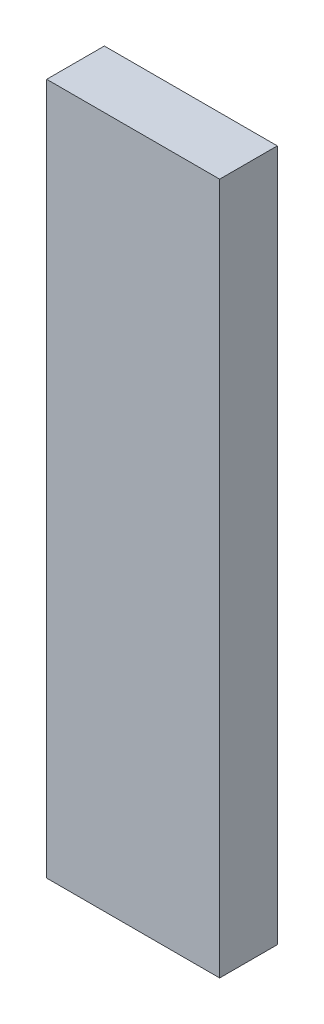
ISO-10303-21;
HEADER;
FILE_DESCRIPTION(('STEP AP214'),'2;1');
FILE_NAME('part.step','',(''),(''),'','','');
FILE_SCHEMA(('AUTOMOTIVE_DESIGN { 1 0 10303 214 1 1 1 1 }'));
ENDSEC;
DATA;
#1=APPLICATION_CONTEXT('core data for automotive mechanical design processes');
#2=APPLICATION_PROTOCOL_DEFINITION('international standard','automotive_design',2000,#1);
#3=PRODUCT_CONTEXT('',#1,'mechanical');
#4=PRODUCT('Part','Part','',(#3));
#5=PRODUCT_RELATED_PRODUCT_CATEGORY('part','',(#4));
#6=PRODUCT_DEFINITION_FORMATION('','',#4);
#7=PRODUCT_DEFINITION_CONTEXT('part definition',#1,'design');
#8=PRODUCT_DEFINITION('design','',#6,#7);
#9=PRODUCT_DEFINITION_SHAPE('','',#8);
#10=(LENGTH_UNIT() NAMED_UNIT(*) SI_UNIT(.MILLI.,.METRE.));
#11=(NAMED_UNIT(*) PLANE_ANGLE_UNIT() SI_UNIT($,.RADIAN.));
#12=(NAMED_UNIT(*) SI_UNIT($,.STERADIAN.) SOLID_ANGLE_UNIT());
#13=UNCERTAINTY_MEASURE_WITH_UNIT(LENGTH_MEASURE(1.E-05),#10,'distance_accuracy_value','');
#14=(GEOMETRIC_REPRESENTATION_CONTEXT(3) GLOBAL_UNCERTAINTY_ASSIGNED_CONTEXT((#13)) GLOBAL_UNIT_ASSIGNED_CONTEXT((#10,
#11,#12)) REPRESENTATION_CONTEXT('',''));
#15=CARTESIAN_POINT('',(0.,0.,0.));
#16=DIRECTION('',(0.,0.,1.));
#17=DIRECTION('',(1.,0.,0.));
#18=AXIS2_PLACEMENT_3D('',#15,#16,#17);
#19=CARTESIAN_POINT('',(0.449999999999999,-1.8,0.3));
#20=DIRECTION('',(-1.,0.,0.));
#21=DIRECTION('',(0.,0.,1.));
#22=AXIS2_PLACEMENT_3D('',#19,#20,#21);
#23=PLANE('',#22);
#24=DIRECTION('',(0.,1.,0.));
#25=VECTOR('',#24,1.);
#26=CARTESIAN_POINT('',(0.449999999999999,-1.8,0.));
#27=LINE('',#26,#25);
#28=CARTESIAN_POINT('',(0.449999999999999,-1.8,0.));
#29=VERTEX_POINT('',#28);
#30=CARTESIAN_POINT('',(0.449999999999999,1.8,0.));
#31=VERTEX_POINT('',#30);
#32=EDGE_CURVE('E97',#29,#31,#27,.T.);
#33=ORIENTED_EDGE('',*,*,#32,.T.);
#34=DIRECTION('',(0.,0.,-1.));
#35=VECTOR('',#34,1.);
#36=CARTESIAN_POINT('',(0.449999999999999,1.8,0.3));
#37=LINE('',#36,#35);
#38=CARTESIAN_POINT('',(0.449999999999999,1.8,0.3));
#39=VERTEX_POINT('',#38);
#40=EDGE_CURVE('E11',#39,#31,#37,.T.);
#41=ORIENTED_EDGE('',*,*,#40,.F.);
#42=DIRECTION('',(0.,1.,0.));
#43=VECTOR('',#42,1.);
#44=CARTESIAN_POINT('',(0.449999999999999,-1.8,0.3));
#45=LINE('',#44,#43);
#46=CARTESIAN_POINT('',(0.449999999999999,-1.8,0.3));
#47=VERTEX_POINT('',#46);
#48=EDGE_CURVE('E85',#47,#39,#45,.T.);
#49=ORIENTED_EDGE('',*,*,#48,.F.);
#50=DIRECTION('',(0.,0.,-1.));
#51=VECTOR('',#50,1.);
#52=CARTESIAN_POINT('',(0.449999999999999,-1.8,0.3));
#53=LINE('',#52,#51);
#54=EDGE_CURVE('E93',#47,#29,#53,.T.);
#55=ORIENTED_EDGE('',*,*,#54,.T.);
#56=EDGE_LOOP('',(#33,#41,#49,#55));
#57=FACE_BOUND('',#56,.T.);
#58=ADVANCED_FACE('F34',(#57),#23,.F.);
#59=CARTESIAN_POINT('',(-0.450000000000001,1.8,0.3));
#60=DIRECTION('',(0.,-1.,0.));
#61=DIRECTION('',(0.,0.,-1.));
#62=AXIS2_PLACEMENT_3D('',#59,#60,#61);
#63=PLANE('',#62);
#64=DIRECTION('',(-1.,0.,0.));
#65=VECTOR('',#64,1.);
#66=CARTESIAN_POINT('',(-0.450000000000001,1.8,0.));
#67=LINE('',#66,#65);
#68=CARTESIAN_POINT('',(-0.450000000000001,1.8,0.));
#69=VERTEX_POINT('',#68);
#70=EDGE_CURVE('E89',#31,#69,#67,.T.);
#71=ORIENTED_EDGE('',*,*,#70,.T.);
#72=DIRECTION('',(0.,0.,-1.));
#73=VECTOR('',#72,1.);
#74=CARTESIAN_POINT('',(-0.450000000000001,1.8,0.3));
#75=LINE('',#74,#73);
#76=CARTESIAN_POINT('',(-0.450000000000001,1.8,0.3));
#77=VERTEX_POINT('',#76);
#78=EDGE_CURVE('E42',#77,#69,#75,.T.);
#79=ORIENTED_EDGE('',*,*,#78,.F.);
#80=DIRECTION('',(-1.,0.,0.));
#81=VECTOR('',#80,1.);
#82=CARTESIAN_POINT('',(-0.450000000000001,1.8,0.3));
#83=LINE('',#82,#81);
#84=EDGE_CURVE('E80',#39,#77,#83,.T.);
#85=ORIENTED_EDGE('',*,*,#84,.F.);
#86=ORIENTED_EDGE('',*,*,#40,.T.);
#87=EDGE_LOOP('',(#71,#79,#85,#86));
#88=FACE_BOUND('',#87,.T.);
#89=ADVANCED_FACE('F88',(#88),#63,.F.);
#90=CARTESIAN_POINT('',(-0.450000000000001,-1.8,0.3));
#91=DIRECTION('',(1.,0.,0.));
#92=DIRECTION('',(0.,0.,-1.));
#93=AXIS2_PLACEMENT_3D('',#90,#91,#92);
#94=PLANE('',#93);
#95=DIRECTION('',(0.,-1.,0.));
#96=VECTOR('',#95,1.);
#97=CARTESIAN_POINT('',(-0.450000000000001,-1.8,0.));
#98=LINE('',#97,#96);
#99=CARTESIAN_POINT('',(-0.450000000000001,-1.8,0.));
#100=VERTEX_POINT('',#99);
#101=EDGE_CURVE('E67',#69,#100,#98,.T.);
#102=ORIENTED_EDGE('',*,*,#101,.T.);
#103=DIRECTION('',(0.,0.,-1.));
#104=VECTOR('',#103,1.);
#105=CARTESIAN_POINT('',(-0.450000000000001,-1.8,0.3));
#106=LINE('',#105,#104);
#107=CARTESIAN_POINT('',(-0.450000000000001,-1.8,0.3));
#108=VERTEX_POINT('',#107);
#109=EDGE_CURVE('E90',#108,#100,#106,.T.);
#110=ORIENTED_EDGE('',*,*,#109,.F.);
#111=DIRECTION('',(0.,-1.,0.));
#112=VECTOR('',#111,1.);
#113=CARTESIAN_POINT('',(-0.450000000000001,-1.8,0.3));
#114=LINE('',#113,#112);
#115=EDGE_CURVE('E83',#77,#108,#114,.T.);
#116=ORIENTED_EDGE('',*,*,#115,.F.);
#117=ORIENTED_EDGE('',*,*,#78,.T.);
#118=EDGE_LOOP('',(#102,#110,#116,#117));
#119=FACE_BOUND('',#118,.T.);
#120=ADVANCED_FACE('F91',(#119),#94,.F.);
#121=CARTESIAN_POINT('',(-0.450000000000001,-1.8,0.3));
#122=DIRECTION('',(0.,1.,0.));
#123=DIRECTION('',(0.,0.,1.));
#124=AXIS2_PLACEMENT_3D('',#121,#122,#123);
#125=PLANE('',#124);
#126=DIRECTION('',(1.,0.,0.));
#127=VECTOR('',#126,1.);
#128=CARTESIAN_POINT('',(-0.450000000000001,-1.8,0.));
#129=LINE('',#128,#127);
#130=EDGE_CURVE('E73',#100,#29,#129,.T.);
#131=ORIENTED_EDGE('',*,*,#130,.T.);
#132=ORIENTED_EDGE('',*,*,#54,.F.);
#133=DIRECTION('',(1.,0.,0.));
#134=VECTOR('',#133,1.);
#135=CARTESIAN_POINT('',(-0.450000000000001,-1.8,0.3));
#136=LINE('',#135,#134);
#137=EDGE_CURVE('E50',#108,#47,#136,.T.);
#138=ORIENTED_EDGE('',*,*,#137,.F.);
#139=ORIENTED_EDGE('',*,*,#109,.T.);
#140=EDGE_LOOP('',(#131,#132,#138,#139));
#141=FACE_BOUND('',#140,.T.);
#142=ADVANCED_FACE('F104',(#141),#125,.F.);
#143=CARTESIAN_POINT('',(0.449999999999999,1.8,0.3));
#144=DIRECTION('',(0.,0.,-1.));
#145=DIRECTION('',(-1.,0.,0.));
#146=AXIS2_PLACEMENT_3D('',#143,#144,#145);
#147=PLANE('',#146);
#148=ORIENTED_EDGE('',*,*,#48,.T.);
#149=ORIENTED_EDGE('',*,*,#84,.T.);
#150=ORIENTED_EDGE('',*,*,#115,.T.);
#151=ORIENTED_EDGE('',*,*,#137,.T.);
#152=EDGE_LOOP('',(#148,#149,#150,#151));
#153=FACE_BOUND('',#152,.T.);
#154=ADVANCED_FACE('F81',(#153),#147,.F.);
#155=CARTESIAN_POINT('',(0.449999999999999,1.8,0.));
#156=DIRECTION('',(0.,0.,-1.));
#157=DIRECTION('',(-1.,0.,0.));
#158=AXIS2_PLACEMENT_3D('',#155,#156,#157);
#159=PLANE('',#158);
#160=ORIENTED_EDGE('',*,*,#32,.F.);
#161=ORIENTED_EDGE('',*,*,#130,.F.);
#162=ORIENTED_EDGE('',*,*,#101,.F.);
#163=ORIENTED_EDGE('',*,*,#70,.F.);
#164=EDGE_LOOP('',(#160,#161,#162,#163));
#165=FACE_BOUND('',#164,.T.);
#166=ADVANCED_FACE('F107',(#165),#159,.T.);
#167=CLOSED_SHELL('',(#58,#89,#120,#142,#154,#166));
#168=MANIFOLD_SOLID_BREP('B2',#167);
#169=ADVANCED_BREP_SHAPE_REPRESENTATION('',(#18,#168),#14);
#170=SHAPE_DEFINITION_REPRESENTATION(#9,#169);
ENDSEC;
END-ISO-10303-21;
